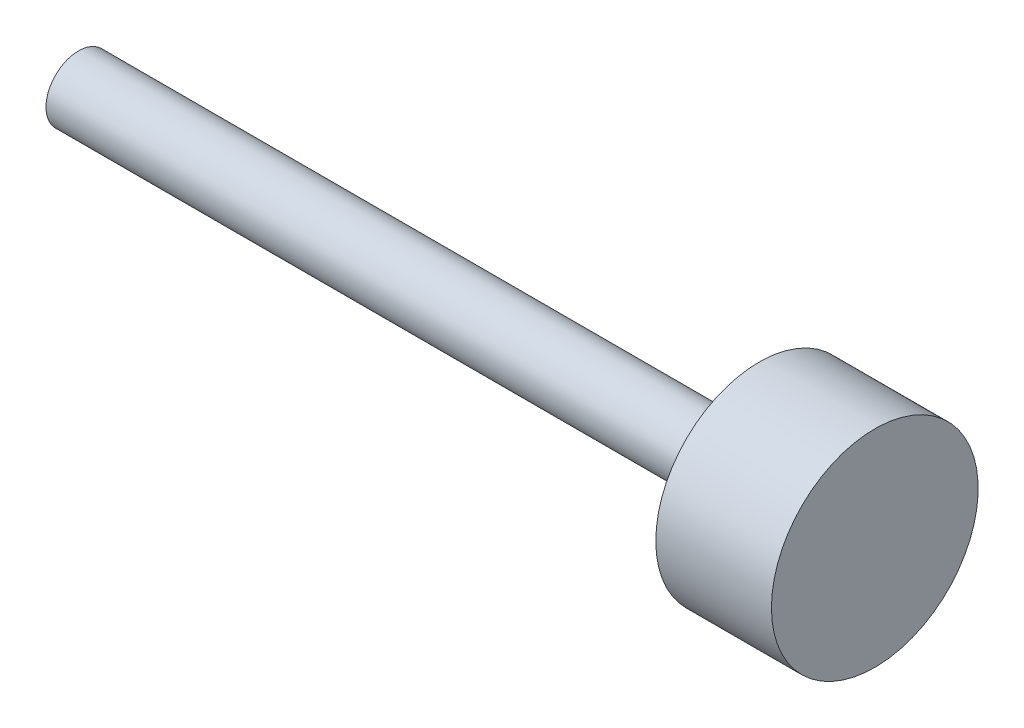
ISO-10303-21;
HEADER;
FILE_DESCRIPTION(('STEP AP214'),'2;1');
FILE_NAME('part.step','',(''),(''),'','','');
FILE_SCHEMA(('AUTOMOTIVE_DESIGN { 1 0 10303 214 1 1 1 1 }'));
ENDSEC;
DATA;
#1=APPLICATION_CONTEXT('core data for automotive mechanical design processes');
#2=APPLICATION_PROTOCOL_DEFINITION('international standard','automotive_design',2000,#1);
#3=PRODUCT_CONTEXT('',#1,'mechanical');
#4=PRODUCT('Part','Part','',(#3));
#5=PRODUCT_RELATED_PRODUCT_CATEGORY('part','',(#4));
#6=PRODUCT_DEFINITION_FORMATION('','',#4);
#7=PRODUCT_DEFINITION_CONTEXT('part definition',#1,'design');
#8=PRODUCT_DEFINITION('design','',#6,#7);
#9=PRODUCT_DEFINITION_SHAPE('','',#8);
#10=(LENGTH_UNIT() NAMED_UNIT(*) SI_UNIT(.MILLI.,.METRE.));
#11=(NAMED_UNIT(*) PLANE_ANGLE_UNIT() SI_UNIT($,.RADIAN.));
#12=(NAMED_UNIT(*) SI_UNIT($,.STERADIAN.) SOLID_ANGLE_UNIT());
#13=UNCERTAINTY_MEASURE_WITH_UNIT(LENGTH_MEASURE(1.E-05),#10,'distance_accuracy_value','');
#14=(GEOMETRIC_REPRESENTATION_CONTEXT(3) GLOBAL_UNCERTAINTY_ASSIGNED_CONTEXT((#13)) GLOBAL_UNIT_ASSIGNED_CONTEXT((#10,
#11,#12)) REPRESENTATION_CONTEXT('',''));
#15=CARTESIAN_POINT('',(0.,0.,0.));
#16=DIRECTION('',(0.,0.,1.));
#17=DIRECTION('',(1.,0.,0.));
#18=AXIS2_PLACEMENT_3D('',#15,#16,#17);
#19=CARTESIAN_POINT('',(-22.225,0.,0.));
#20=DIRECTION('',(1.,0.,0.));
#21=DIRECTION('',(0.,0.,-1.));
#22=AXIS2_PLACEMENT_3D('',#19,#20,#21);
#23=PLANE('',#22);
#24=CARTESIAN_POINT('',(-22.225,0.,0.));
#25=DIRECTION('',(-1.,0.,0.));
#26=DIRECTION('',(0.,0.,1.));
#27=AXIS2_PLACEMENT_3D('',#24,#25,#26);
#28=CIRCLE('',#27,5.55625);
#29=CARTESIAN_POINT('',(-22.225,0.,5.55625));
#30=VERTEX_POINT('',#29);
#31=EDGE_CURVE('E63',#30,#30,#28,.T.);
#32=ORIENTED_EDGE('',*,*,#31,.F.);
#33=EDGE_LOOP('',(#32));
#34=FACE_BOUND('',#33,.T.);
#35=CARTESIAN_POINT('',(-22.225,0.,0.));
#36=DIRECTION('',(-1.,0.,0.));
#37=DIRECTION('',(0.,0.,1.));
#38=AXIS2_PLACEMENT_3D('',#35,#36,#37);
#39=CIRCLE('',#38,8.001);
#40=CARTESIAN_POINT('',(-22.225,0.,8.001));
#41=VERTEX_POINT('',#40);
#42=EDGE_CURVE('E11',#41,#41,#39,.T.);
#43=ORIENTED_EDGE('',*,*,#42,.T.);
#44=EDGE_LOOP('',(#43));
#45=FACE_BOUND('',#44,.T.);
#46=ADVANCED_FACE('F37',(#34,#45),#23,.F.);
#47=CARTESIAN_POINT('',(173.8376,0.,0.));
#48=DIRECTION('',(-1.,0.,0.));
#49=DIRECTION('',(0.,0.,1.));
#50=AXIS2_PLACEMENT_3D('',#47,#48,#49);
#51=CYLINDRICAL_SURFACE('',#50,8.001);
#52=ORIENTED_EDGE('',*,*,#42,.F.);
#53=EDGE_LOOP('',(#52));
#54=FACE_BOUND('',#53,.T.);
#55=CARTESIAN_POINT('',(145.3642,0.,0.));
#56=DIRECTION('',(-1.,0.,0.));
#57=DIRECTION('',(0.,0.,1.));
#58=AXIS2_PLACEMENT_3D('',#55,#56,#57);
#59=CIRCLE('',#58,8.001);
#60=CARTESIAN_POINT('',(145.3642,0.,8.001));
#61=VERTEX_POINT('',#60);
#62=EDGE_CURVE('E43',#61,#61,#59,.T.);
#63=ORIENTED_EDGE('',*,*,#62,.T.);
#64=EDGE_LOOP('',(#63));
#65=FACE_BOUND('',#64,.T.);
#66=ADVANCED_FACE('F71',(#54,#65),#51,.T.);
#67=CARTESIAN_POINT('',(145.3642,8.001,0.));
#68=DIRECTION('',(1.,0.,0.));
#69=DIRECTION('',(0.,0.,-1.));
#70=AXIS2_PLACEMENT_3D('',#67,#68,#69);
#71=PLANE('',#70);
#72=ORIENTED_EDGE('',*,*,#62,.F.);
#73=EDGE_LOOP('',(#72));
#74=FACE_BOUND('',#73,.T.);
#75=CARTESIAN_POINT('',(145.3642,0.,0.));
#76=DIRECTION('',(-1.,0.,0.));
#77=DIRECTION('',(0.,0.,1.));
#78=AXIS2_PLACEMENT_3D('',#75,#76,#77);
#79=CIRCLE('',#78,25.4508);
#80=CARTESIAN_POINT('',(145.3642,0.,25.4508));
#81=VERTEX_POINT('',#80);
#82=EDGE_CURVE('E60',#81,#81,#79,.T.);
#83=ORIENTED_EDGE('',*,*,#82,.T.);
#84=EDGE_LOOP('',(#83));
#85=FACE_BOUND('',#84,.T.);
#86=ADVANCED_FACE('F73',(#74,#85),#71,.F.);
#87=CARTESIAN_POINT('',(173.8376,0.,0.));
#88=DIRECTION('',(-1.,0.,0.));
#89=DIRECTION('',(0.,0.,1.));
#90=AXIS2_PLACEMENT_3D('',#87,#88,#89);
#91=CYLINDRICAL_SURFACE('',#90,25.4508);
#92=ORIENTED_EDGE('',*,*,#82,.F.);
#93=EDGE_LOOP('',(#92));
#94=FACE_BOUND('',#93,.T.);
#95=CARTESIAN_POINT('',(173.8376,0.,0.));
#96=DIRECTION('',(-1.,0.,0.));
#97=DIRECTION('',(0.,0.,1.));
#98=AXIS2_PLACEMENT_3D('',#95,#96,#97);
#99=CIRCLE('',#98,25.4508);
#100=CARTESIAN_POINT('',(173.8376,0.,25.4508));
#101=VERTEX_POINT('',#100);
#102=EDGE_CURVE('E56',#101,#101,#99,.T.);
#103=ORIENTED_EDGE('',*,*,#102,.T.);
#104=EDGE_LOOP('',(#103));
#105=FACE_BOUND('',#104,.T.);
#106=ADVANCED_FACE('F76',(#94,#105),#91,.T.);
#107=CARTESIAN_POINT('',(173.8376,25.4508,0.));
#108=DIRECTION('',(-1.,0.,0.));
#109=DIRECTION('',(0.,0.,1.));
#110=AXIS2_PLACEMENT_3D('',#107,#108,#109);
#111=PLANE('',#110);
#112=ORIENTED_EDGE('',*,*,#102,.F.);
#113=EDGE_LOOP('',(#112));
#114=FACE_BOUND('',#113,.T.);
#115=ADVANCED_FACE('F50',(#114),#111,.F.);
#116=CARTESIAN_POINT('',(5.83747761626726,0.,0.));
#117=DIRECTION('',(-1.,0.,0.));
#118=DIRECTION('',(0.,0.,1.));
#119=AXIS2_PLACEMENT_3D('',#116,#117,#118);
#120=CONICAL_SURFACE('',#119,4.86918,1.0471975511966);
#121=CARTESIAN_POINT('',(8.64870000000002,0.,0.));
#122=VERTEX_POINT('',#121);
#123=VERTEX_LOOP('',#122);
#124=FACE_BOUND('',#123,.T.);
#125=CARTESIAN_POINT('',(5.83747761626726,0.,0.));
#126=DIRECTION('',(-1.,0.,0.));
#127=DIRECTION('',(0.,0.,1.));
#128=AXIS2_PLACEMENT_3D('',#125,#126,#127);
#129=CIRCLE('',#128,4.86918);
#130=CARTESIAN_POINT('',(5.83747761626726,0.,4.86918));
#131=VERTEX_POINT('',#130);
#132=EDGE_CURVE('E54',#131,#131,#129,.T.);
#133=ORIENTED_EDGE('',*,*,#132,.T.);
#134=EDGE_LOOP('',(#133));
#135=FACE_BOUND('',#134,.T.);
#136=ADVANCED_FACE('F46',(#124,#135),#120,.F.);
#137=CARTESIAN_POINT('',(-22.225,0.,0.));
#138=DIRECTION('',(-1.,0.,0.));
#139=DIRECTION('',(0.,0.,1.));
#140=AXIS2_PLACEMENT_3D('',#137,#138,#139);
#141=CYLINDRICAL_SURFACE('',#140,4.86918);
#142=ORIENTED_EDGE('',*,*,#132,.F.);
#143=EDGE_LOOP('',(#142));
#144=FACE_BOUND('',#143,.T.);
#145=CARTESIAN_POINT('',(-21.53793,0.,0.));
#146=DIRECTION('',(-1.,0.,0.));
#147=DIRECTION('',(0.,0.,1.));
#148=AXIS2_PLACEMENT_3D('',#145,#146,#147);
#149=CIRCLE('',#148,4.86918);
#150=CARTESIAN_POINT('',(-21.53793,0.,4.86918));
#151=VERTEX_POINT('',#150);
#152=EDGE_CURVE('E57',#151,#151,#149,.T.);
#153=ORIENTED_EDGE('',*,*,#152,.T.);
#154=EDGE_LOOP('',(#153));
#155=FACE_BOUND('',#154,.T.);
#156=ADVANCED_FACE('F49',(#144,#155),#141,.F.);
#157=CARTESIAN_POINT('',(-22.225,0.,0.));
#158=DIRECTION('',(-1.,0.,0.));
#159=DIRECTION('',(0.,0.,1.));
#160=AXIS2_PLACEMENT_3D('',#157,#158,#159);
#161=CONICAL_SURFACE('',#160,5.55625,0.785398163397446);
#162=ORIENTED_EDGE('',*,*,#152,.F.);
#163=EDGE_LOOP('',(#162));
#164=FACE_BOUND('',#163,.T.);
#165=ORIENTED_EDGE('',*,*,#31,.T.);
#166=EDGE_LOOP('',(#165));
#167=FACE_BOUND('',#166,.T.);
#168=ADVANCED_FACE('F100',(#164,#167),#161,.F.);
#169=CLOSED_SHELL('',(#46,#66,#86,#106,#115,#136,#156,#168));
#170=MANIFOLD_SOLID_BREP('B2',#169);
#171=ADVANCED_BREP_SHAPE_REPRESENTATION('',(#18,#170),#14);
#172=SHAPE_DEFINITION_REPRESENTATION(#9,#171);
ENDSEC;
END-ISO-10303-21;
